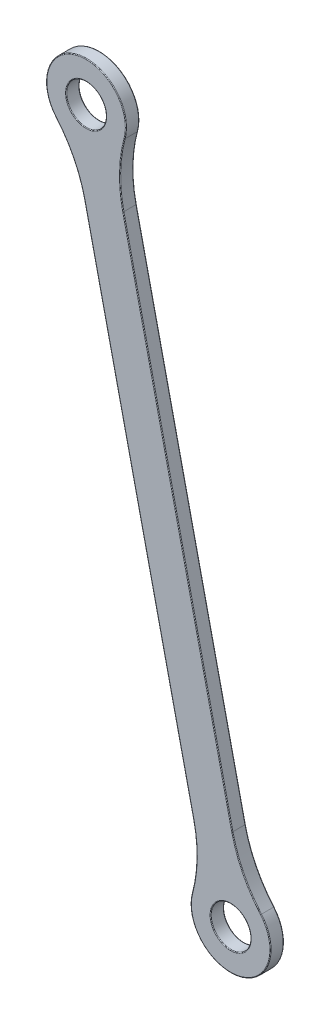
ISO-10303-21;
HEADER;
FILE_DESCRIPTION(('STEP AP214'),'2;1');
FILE_NAME('part.step','',(''),(''),'','','');
FILE_SCHEMA(('AUTOMOTIVE_DESIGN { 1 0 10303 214 1 1 1 1 }'));
ENDSEC;
DATA;
#1=APPLICATION_CONTEXT('core data for automotive mechanical design processes');
#2=APPLICATION_PROTOCOL_DEFINITION('international standard','automotive_design',2000,#1);
#3=PRODUCT_CONTEXT('',#1,'mechanical');
#4=PRODUCT('Part','Part','',(#3));
#5=PRODUCT_RELATED_PRODUCT_CATEGORY('part','',(#4));
#6=PRODUCT_DEFINITION_FORMATION('','',#4);
#7=PRODUCT_DEFINITION_CONTEXT('part definition',#1,'design');
#8=PRODUCT_DEFINITION('design','',#6,#7);
#9=PRODUCT_DEFINITION_SHAPE('','',#8);
#10=(LENGTH_UNIT() NAMED_UNIT(*) SI_UNIT(.MILLI.,.METRE.));
#11=(NAMED_UNIT(*) PLANE_ANGLE_UNIT() SI_UNIT($,.RADIAN.));
#12=(NAMED_UNIT(*) SI_UNIT($,.STERADIAN.) SOLID_ANGLE_UNIT());
#13=UNCERTAINTY_MEASURE_WITH_UNIT(LENGTH_MEASURE(1.E-05),#10,'distance_accuracy_value','');
#14=(GEOMETRIC_REPRESENTATION_CONTEXT(3) GLOBAL_UNCERTAINTY_ASSIGNED_CONTEXT((#13)) GLOBAL_UNIT_ASSIGNED_CONTEXT((#10,
#11,#12)) REPRESENTATION_CONTEXT('',''));
#15=CARTESIAN_POINT('',(0.,0.,0.));
#16=DIRECTION('',(0.,0.,1.));
#17=DIRECTION('',(1.,0.,0.));
#18=AXIS2_PLACEMENT_3D('',#15,#16,#17);
#19=CARTESIAN_POINT('',(14.5,81.5,-3.));
#20=DIRECTION('',(0.,0.,1.));
#21=DIRECTION('',(1.,0.,0.));
#22=AXIS2_PLACEMENT_3D('',#19,#20,#21);
#23=CYLINDRICAL_SURFACE('',#22,8.99999999999999);
#24=DIRECTION('',(0.,0.,1.));
#25=VECTOR('',#24,1.);
#26=CARTESIAN_POINT('',(21.3408329042481,87.3483335383813,-3.));
#27=LINE('',#26,#25);
#28=CARTESIAN_POINT('',(21.3408329042481,87.3483335383813,-2.85));
#29=VERTEX_POINT('',#28);
#30=CARTESIAN_POINT('',(21.3408329042481,87.3483335383813,-0.15));
#31=VERTEX_POINT('',#30);
#32=EDGE_CURVE('E301',#29,#31,#27,.T.);
#33=ORIENTED_EDGE('',*,*,#32,.T.);
#34=CARTESIAN_POINT('',(14.5,81.5,-0.15));
#35=DIRECTION('',(0.,0.,1.));
#36=DIRECTION('',(1.,0.,0.));
#37=AXIS2_PLACEMENT_3D('',#34,#35,#36);
#38=CIRCLE('',#37,8.99999999999999);
#39=CARTESIAN_POINT('',(5.8092709229788,83.8390656488902,-0.15));
#40=VERTEX_POINT('',#39);
#41=EDGE_CURVE('E223',#31,#40,#38,.F.);
#42=ORIENTED_EDGE('',*,*,#41,.T.);
#43=DIRECTION('',(0.,0.,1.));
#44=VECTOR('',#43,1.);
#45=CARTESIAN_POINT('',(5.8092709229788,83.8390656488902,-3.));
#46=LINE('',#45,#44);
#47=CARTESIAN_POINT('',(5.8092709229788,83.8390656488902,-2.85));
#48=VERTEX_POINT('',#47);
#49=EDGE_CURVE('E295',#40,#48,#46,.F.);
#50=ORIENTED_EDGE('',*,*,#49,.T.);
#51=CARTESIAN_POINT('',(14.5,81.5,-2.85));
#52=DIRECTION('',(0.,0.,1.));
#53=DIRECTION('',(1.,0.,0.));
#54=AXIS2_PLACEMENT_3D('',#51,#52,#53);
#55=CIRCLE('',#54,8.99999999999999);
#56=EDGE_CURVE('E221',#48,#29,#55,.T.);
#57=ORIENTED_EDGE('',*,*,#56,.T.);
#58=EDGE_LOOP('',(#33,#42,#50,#57));
#59=FACE_BOUND('',#58,.T.);
#60=ADVANCED_FACE('F35',(#59),#23,.T.);
#61=CARTESIAN_POINT('',(26.9264102543351,6.08386889861802,-3.));
#62=DIRECTION('',(0.975412105103872,0.220388804654032,0.));
#63=DIRECTION('',(-0.220388804654032,0.975412105103872,0.));
#64=AXIS2_PLACEMENT_3D('',#61,#62,#63);
#65=PLANE('',#64);
#66=DIRECTION('',(0.,0.,-1.));
#67=VECTOR('',#66,1.);
#68=CARTESIAN_POINT('',(6.10253715269095,98.2476152848119,0.));
#69=LINE('',#68,#67);
#70=CARTESIAN_POINT('',(6.10253715269095,98.2476152848119,-2.85));
#71=VERTEX_POINT('',#70);
#72=CARTESIAN_POINT('',(6.10253715269095,98.2476152848119,-0.15));
#73=VERTEX_POINT('',#72);
#74=EDGE_CURVE('E297',#71,#73,#69,.F.);
#75=ORIENTED_EDGE('',*,*,#74,.T.);
#76=DIRECTION('',(-0.220388804654032,0.975412105103872,0.));
#77=VECTOR('',#76,1.);
#78=CARTESIAN_POINT('',(-18.4987891874225,207.129877028675,-0.15));
#79=LINE('',#78,#77);
#80=CARTESIAN_POINT('',(-18.4987891874225,207.129877028675,-0.15));
#81=VERTEX_POINT('',#80);
#82=EDGE_CURVE('E198',#73,#81,#79,.T.);
#83=ORIENTED_EDGE('',*,*,#82,.T.);
#84=DIRECTION('',(0.,0.,1.));
#85=VECTOR('',#84,1.);
#86=CARTESIAN_POINT('',(-18.4987891874225,207.129877028675,-3.));
#87=LINE('',#86,#85);
#88=CARTESIAN_POINT('',(-18.4987891874225,207.129877028675,-2.85));
#89=VERTEX_POINT('',#88);
#90=EDGE_CURVE('E336',#81,#89,#87,.F.);
#91=ORIENTED_EDGE('',*,*,#90,.T.);
#92=DIRECTION('',(-0.220388804654032,0.975412105103872,0.));
#93=VECTOR('',#92,1.);
#94=CARTESIAN_POINT('',(26.9264102543351,6.08386889861802,-2.85));
#95=LINE('',#94,#93);
#96=EDGE_CURVE('E196',#89,#71,#95,.F.);
#97=ORIENTED_EDGE('',*,*,#96,.T.);
#98=EDGE_LOOP('',(#75,#83,#91,#97));
#99=FACE_BOUND('',#98,.T.);
#100=ADVANCED_FACE('F335',(#99),#65,.F.);
#101=CARTESIAN_POINT('',(-18.1175430887967,225.860991555373,-3.));
#102=DIRECTION('',(0.,0.,1.));
#103=DIRECTION('',(1.,0.,0.));
#104=AXIS2_PLACEMENT_3D('',#101,#102,#103);
#105=CYLINDRICAL_SURFACE('',#104,9.00000000000001);
#106=DIRECTION('',(0.,0.,1.));
#107=VECTOR('',#106,1.);
#108=CARTESIAN_POINT('',(-24.9583759930449,220.012658016992,-3.));
#109=LINE('',#108,#107);
#110=CARTESIAN_POINT('',(-24.9583759930449,220.012658016992,-2.85));
#111=VERTEX_POINT('',#110);
#112=CARTESIAN_POINT('',(-24.9583759930449,220.012658016992,-0.15));
#113=VERTEX_POINT('',#112);
#114=EDGE_CURVE('E258',#111,#113,#109,.T.);
#115=ORIENTED_EDGE('',*,*,#114,.T.);
#116=CARTESIAN_POINT('',(-18.1175430887967,225.860991555373,-0.15));
#117=DIRECTION('',(0.,0.,1.));
#118=DIRECTION('',(1.,0.,0.));
#119=AXIS2_PLACEMENT_3D('',#116,#117,#118);
#120=CIRCLE('',#119,9.00000000000001);
#121=CARTESIAN_POINT('',(-9.4268140117755,223.521925906483,-0.15));
#122=VERTEX_POINT('',#121);
#123=EDGE_CURVE('E206',#113,#122,#120,.F.);
#124=ORIENTED_EDGE('',*,*,#123,.T.);
#125=DIRECTION('',(0.,0.,1.));
#126=VECTOR('',#125,1.);
#127=CARTESIAN_POINT('',(-9.4268140117755,223.521925906483,-3.));
#128=LINE('',#127,#126);
#129=CARTESIAN_POINT('',(-9.4268140117755,223.521925906483,-2.85));
#130=VERTEX_POINT('',#129);
#131=EDGE_CURVE('E305',#122,#130,#128,.F.);
#132=ORIENTED_EDGE('',*,*,#131,.T.);
#133=CARTESIAN_POINT('',(-18.1175430887967,225.860991555373,-2.85));
#134=DIRECTION('',(0.,0.,1.));
#135=DIRECTION('',(1.,0.,0.));
#136=AXIS2_PLACEMENT_3D('',#133,#134,#135);
#137=CIRCLE('',#136,9.00000000000001);
#138=EDGE_CURVE('E204',#130,#111,#137,.T.);
#139=ORIENTED_EDGE('',*,*,#138,.T.);
#140=EDGE_LOOP('',(#115,#124,#132,#139));
#141=FACE_BOUND('',#140,.T.);
#142=ADVANCED_FACE('F347',(#141),#105,.T.);
#143=CARTESIAN_POINT('',(-18.1175430887967,225.860991555373,-3.));
#144=DIRECTION('',(0.,0.,1.));
#145=DIRECTION('',(1.,0.,0.));
#146=AXIS2_PLACEMENT_3D('',#143,#144,#145);
#147=CYLINDRICAL_SURFACE('',#146,4.5);
#148=CARTESIAN_POINT('',(-18.1175430887967,225.860991555373,-0.15));
#149=DIRECTION('',(0.,0.,1.));
#150=DIRECTION('',(1.,0.,0.));
#151=AXIS2_PLACEMENT_3D('',#148,#149,#150);
#152=CIRCLE('',#151,4.5);
#153=CARTESIAN_POINT('',(-13.6175430887967,225.860991555373,-0.15));
#154=VERTEX_POINT('',#153);
#155=EDGE_CURVE('E190',#154,#154,#152,.T.);
#156=ORIENTED_EDGE('',*,*,#155,.T.);
#157=EDGE_LOOP('',(#156));
#158=FACE_BOUND('',#157,.T.);
#159=CARTESIAN_POINT('',(-18.1175430887967,225.860991555373,-2.85));
#160=DIRECTION('',(0.,0.,1.));
#161=DIRECTION('',(1.,0.,0.));
#162=AXIS2_PLACEMENT_3D('',#159,#160,#161);
#163=CIRCLE('',#162,4.5);
#164=CARTESIAN_POINT('',(-13.6175430887967,225.860991555373,-2.85));
#165=VERTEX_POINT('',#164);
#166=EDGE_CURVE('E187',#165,#165,#163,.F.);
#167=ORIENTED_EDGE('',*,*,#166,.T.);
#168=EDGE_LOOP('',(#167));
#169=FACE_BOUND('',#168,.T.);
#170=ADVANCED_FACE('F623',(#158,#169),#147,.F.);
#171=CARTESIAN_POINT('',(35.70511920027,8.06736814050431,-3.));
#172=DIRECTION('',(0.975412105103872,0.220388804654032,0.));
#173=DIRECTION('',(-0.220388804654032,0.975412105103872,0.));
#174=AXIS2_PLACEMENT_3D('',#171,#172,#173);
#175=PLANE('',#174);
#176=DIRECTION('',(0.,0.,-1.));
#177=VECTOR('',#176,1.);
#178=CARTESIAN_POINT('',(-9.72008024148765,209.113376270561,0.));
#179=LINE('',#178,#177);
#180=CARTESIAN_POINT('',(-9.72008024148765,209.113376270561,-2.85));
#181=VERTEX_POINT('',#180);
#182=CARTESIAN_POINT('',(-9.72008024148765,209.113376270561,-0.15));
#183=VERTEX_POINT('',#182);
#184=EDGE_CURVE('E338',#181,#183,#179,.F.);
#185=ORIENTED_EDGE('',*,*,#184,.T.);
#186=DIRECTION('',(-0.220388804654032,0.975412105103872,0.));
#187=VECTOR('',#186,1.);
#188=CARTESIAN_POINT('',(35.70511920027,8.06736814050431,-0.15));
#189=LINE('',#188,#187);
#190=CARTESIAN_POINT('',(14.8812460986258,100.231114526698,-0.15));
#191=VERTEX_POINT('',#190);
#192=EDGE_CURVE('E215',#183,#191,#189,.F.);
#193=ORIENTED_EDGE('',*,*,#192,.T.);
#194=DIRECTION('',(0.,0.,1.));
#195=VECTOR('',#194,1.);
#196=CARTESIAN_POINT('',(14.8812460986258,100.231114526698,-3.));
#197=LINE('',#196,#195);
#198=CARTESIAN_POINT('',(14.8812460986258,100.231114526698,-2.85));
#199=VERTEX_POINT('',#198);
#200=EDGE_CURVE('E303',#191,#199,#197,.F.);
#201=ORIENTED_EDGE('',*,*,#200,.T.);
#202=DIRECTION('',(-0.220388804654032,0.975412105103872,0.));
#203=VECTOR('',#202,1.);
#204=CARTESIAN_POINT('',(-9.72008024148767,209.113376270561,-2.85));
#205=LINE('',#204,#203);
#206=EDGE_CURVE('E213',#199,#181,#205,.T.);
#207=ORIENTED_EDGE('',*,*,#206,.T.);
#208=EDGE_LOOP('',(#185,#193,#201,#207));
#209=FACE_BOUND('',#208,.T.);
#210=ADVANCED_FACE('F383',(#209),#175,.T.);
#211=CARTESIAN_POINT('',(14.5,81.5,-3.));
#212=DIRECTION('',(0.,0.,1.));
#213=DIRECTION('',(1.,0.,0.));
#214=AXIS2_PLACEMENT_3D('',#211,#212,#213);
#215=CYLINDRICAL_SURFACE('',#214,4.5);
#216=CARTESIAN_POINT('',(14.5,81.5,-0.15));
#217=DIRECTION('',(0.,0.,1.));
#218=DIRECTION('',(1.,0.,0.));
#219=AXIS2_PLACEMENT_3D('',#216,#217,#218);
#220=CIRCLE('',#219,4.5);
#221=CARTESIAN_POINT('',(19.,81.5,-0.15));
#222=VERTEX_POINT('',#221);
#223=EDGE_CURVE('E170',#222,#222,#220,.T.);
#224=ORIENTED_EDGE('',*,*,#223,.T.);
#225=EDGE_LOOP('',(#224));
#226=FACE_BOUND('',#225,.T.);
#227=CARTESIAN_POINT('',(14.5,81.5,-2.85));
#228=DIRECTION('',(0.,0.,1.));
#229=DIRECTION('',(1.,0.,0.));
#230=AXIS2_PLACEMENT_3D('',#227,#228,#229);
#231=CIRCLE('',#230,4.5);
#232=CARTESIAN_POINT('',(19.,81.5,-2.85));
#233=VERTEX_POINT('',#232);
#234=EDGE_CURVE('E311',#233,#233,#231,.F.);
#235=ORIENTED_EDGE('',*,*,#234,.T.);
#236=EDGE_LOOP('',(#235));
#237=FACE_BOUND('',#236,.T.);
#238=ADVANCED_FACE('F601',(#226,#237),#215,.F.);
#239=CARTESIAN_POINT('',(0.,0.,-3.));
#240=DIRECTION('',(0.,0.,1.));
#241=DIRECTION('',(1.,0.,0.));
#242=AXIS2_PLACEMENT_3D('',#239,#240,#241);
#243=PLANE('',#242);
#244=CARTESIAN_POINT('',(14.5,81.5,-3.));
#245=DIRECTION('',(0.,0.,1.));
#246=DIRECTION('',(1.,0.,0.));
#247=AXIS2_PLACEMENT_3D('',#244,#245,#246);
#248=CIRCLE('',#247,4.65);
#249=CARTESIAN_POINT('',(19.15,81.5,-3.));
#250=VERTEX_POINT('',#249);
#251=EDGE_CURVE('E11',#250,#250,#248,.T.);
#252=ORIENTED_EDGE('',*,*,#251,.T.);
#253=EDGE_LOOP('',(#252));
#254=FACE_BOUND('',#253,.T.);
#255=CARTESIAN_POINT('',(-18.1175430887967,225.860991555373,-3.));
#256=DIRECTION('',(0.,0.,1.));
#257=DIRECTION('',(1.,0.,0.));
#258=AXIS2_PLACEMENT_3D('',#255,#256,#257);
#259=CIRCLE('',#258,4.65);
#260=CARTESIAN_POINT('',(-13.4675430887967,225.860991555373,-3.));
#261=VERTEX_POINT('',#260);
#262=EDGE_CURVE('E44',#261,#261,#259,.T.);
#263=ORIENTED_EDGE('',*,*,#262,.T.);
#264=EDGE_LOOP('',(#263));
#265=FACE_BOUND('',#264,.T.);
#266=CARTESIAN_POINT('',(-18.1175430887967,225.860991555373,-3.));
#267=DIRECTION('',(0.,0.,1.));
#268=DIRECTION('',(1.,0.,0.));
#269=AXIS2_PLACEMENT_3D('',#266,#267,#268);
#270=CIRCLE('',#269,8.85);
#271=CARTESIAN_POINT('',(-24.8443621113074,220.110130242631,-3.));
#272=VERTEX_POINT('',#271);
#273=CARTESIAN_POINT('',(-9.57165949639252,223.560910333964,-3.));
#274=VERTEX_POINT('',#273);
#275=EDGE_CURVE('E52',#272,#274,#270,.F.);
#276=ORIENTED_EDGE('',*,*,#275,.T.);
#277=CARTESIAN_POINT('',(19.5422829116285,215.725040410182,-3.));
#278=DIRECTION('',(0.,0.,1.));
#279=DIRECTION('',(1.,0.,0.));
#280=AXIS2_PLACEMENT_3D('',#277,#278,#279);
#281=CIRCLE('',#280,30.15);
#282=CARTESIAN_POINT('',(-9.86639205725324,209.080317949863,-3.));
#283=VERTEX_POINT('',#282);
#284=EDGE_CURVE('E237',#274,#283,#281,.T.);
#285=ORIENTED_EDGE('',*,*,#284,.T.);
#286=DIRECTION('',(-0.220388804654032,0.975412105103872,0.));
#287=VECTOR('',#286,1.);
#288=CARTESIAN_POINT('',(14.7349342828602,100.198056206,-3.));
#289=LINE('',#288,#287);
#290=CARTESIAN_POINT('',(14.7349342828602,100.198056206,-3.));
#291=VERTEX_POINT('',#290);
#292=EDGE_CURVE('E225',#283,#291,#289,.F.);
#293=ORIENTED_EDGE('',*,*,#292,.T.);
#294=CARTESIAN_POINT('',(44.143609251742,106.842778666319,-3.));
#295=DIRECTION('',(0.,0.,1.));
#296=DIRECTION('',(1.,0.,0.));
#297=AXIS2_PLACEMENT_3D('',#294,#295,#296);
#298=CIRCLE('',#297,30.15);
#299=CARTESIAN_POINT('',(21.2268190225107,87.2508613127416,-3.));
#300=VERTEX_POINT('',#299);
#301=EDGE_CURVE('E227',#291,#300,#298,.T.);
#302=ORIENTED_EDGE('',*,*,#301,.T.);
#303=CARTESIAN_POINT('',(14.5,81.5,-3.));
#304=DIRECTION('',(0.,0.,1.));
#305=DIRECTION('',(1.,0.,0.));
#306=AXIS2_PLACEMENT_3D('',#303,#304,#305);
#307=CIRCLE('',#306,8.84999999999999);
#308=CARTESIAN_POINT('',(5.95411640759583,83.8000812214087,-3.));
#309=VERTEX_POINT('',#308);
#310=EDGE_CURVE('E229',#300,#309,#307,.F.);
#311=ORIENTED_EDGE('',*,*,#310,.T.);
#312=CARTESIAN_POINT('',(-23.1598260004252,91.6359511451909,-3.));
#313=DIRECTION('',(0.,0.,1.));
#314=DIRECTION('',(1.,0.,0.));
#315=AXIS2_PLACEMENT_3D('',#312,#313,#314);
#316=CIRCLE('',#315,30.15);
#317=CARTESIAN_POINT('',(6.24884896845654,98.28067360551,-3.));
#318=VERTEX_POINT('',#317);
#319=EDGE_CURVE('E231',#309,#318,#316,.T.);
#320=ORIENTED_EDGE('',*,*,#319,.T.);
#321=DIRECTION('',(-0.220388804654032,0.975412105103872,0.));
#322=VECTOR('',#321,1.);
#323=CARTESIAN_POINT('',(27.0727220701007,6.11692721931613,-3.));
#324=LINE('',#323,#322);
#325=CARTESIAN_POINT('',(-18.3524773716569,207.162935349373,-3.));
#326=VERTEX_POINT('',#325);
#327=EDGE_CURVE('E233',#318,#326,#324,.T.);
#328=ORIENTED_EDGE('',*,*,#327,.T.);
#329=CARTESIAN_POINT('',(-47.7611523405386,200.518212889054,-3.));
#330=DIRECTION('',(0.,0.,1.));
#331=DIRECTION('',(1.,0.,0.));
#332=AXIS2_PLACEMENT_3D('',#329,#330,#331);
#333=CIRCLE('',#332,30.15);
#334=EDGE_CURVE('E57',#326,#272,#333,.T.);
#335=ORIENTED_EDGE('',*,*,#334,.T.);
#336=EDGE_LOOP('',(#276,#285,#293,#302,#311,#320,#328,#335));
#337=FACE_BOUND('',#336,.T.);
#338=ADVANCED_FACE('F588',(#254,#265,#337),#243,.F.);
#339=CARTESIAN_POINT('',(0.,0.,0.));
#340=DIRECTION('',(0.,0.,1.));
#341=DIRECTION('',(1.,0.,0.));
#342=AXIS2_PLACEMENT_3D('',#339,#340,#341);
#343=PLANE('',#342);
#344=CARTESIAN_POINT('',(14.5,81.5,0.));
#345=DIRECTION('',(0.,0.,1.));
#346=DIRECTION('',(1.,0.,0.));
#347=AXIS2_PLACEMENT_3D('',#344,#345,#346);
#348=CIRCLE('',#347,4.65);
#349=CARTESIAN_POINT('',(19.15,81.5,0.));
#350=VERTEX_POINT('',#349);
#351=EDGE_CURVE('E179',#350,#350,#348,.F.);
#352=ORIENTED_EDGE('',*,*,#351,.T.);
#353=EDGE_LOOP('',(#352));
#354=FACE_BOUND('',#353,.T.);
#355=CARTESIAN_POINT('',(-18.1175430887967,225.860991555373,0.));
#356=DIRECTION('',(0.,0.,1.));
#357=DIRECTION('',(1.,0.,0.));
#358=AXIS2_PLACEMENT_3D('',#355,#356,#357);
#359=CIRCLE('',#358,4.65);
#360=CARTESIAN_POINT('',(-13.4675430887967,225.860991555373,0.));
#361=VERTEX_POINT('',#360);
#362=EDGE_CURVE('E176',#361,#361,#359,.F.);
#363=ORIENTED_EDGE('',*,*,#362,.T.);
#364=EDGE_LOOP('',(#363));
#365=FACE_BOUND('',#364,.T.);
#366=DIRECTION('',(-0.220388804654032,0.975412105103872,0.));
#367=VECTOR('',#366,1.);
#368=CARTESIAN_POINT('',(6.24884896845653,98.28067360551,0.));
#369=LINE('',#368,#367);
#370=CARTESIAN_POINT('',(-18.3524773716569,207.162935349373,0.));
#371=VERTEX_POINT('',#370);
#372=CARTESIAN_POINT('',(6.24884896845654,98.28067360551,0.));
#373=VERTEX_POINT('',#372);
#374=EDGE_CURVE('E174',#371,#373,#369,.F.);
#375=ORIENTED_EDGE('',*,*,#374,.T.);
#376=CARTESIAN_POINT('',(-23.1598260004252,91.6359511451909,0.));
#377=DIRECTION('',(0.,0.,1.));
#378=DIRECTION('',(1.,0.,0.));
#379=AXIS2_PLACEMENT_3D('',#376,#377,#378);
#380=CIRCLE('',#379,30.15);
#381=CARTESIAN_POINT('',(5.95411640759583,83.8000812214087,0.));
#382=VERTEX_POINT('',#381);
#383=EDGE_CURVE('E155',#373,#382,#380,.F.);
#384=ORIENTED_EDGE('',*,*,#383,.T.);
#385=CARTESIAN_POINT('',(14.5,81.5,0.));
#386=DIRECTION('',(0.,0.,1.));
#387=DIRECTION('',(1.,0.,0.));
#388=AXIS2_PLACEMENT_3D('',#385,#386,#387);
#389=CIRCLE('',#388,8.84999999999999);
#390=CARTESIAN_POINT('',(21.2268190225107,87.2508613127416,0.));
#391=VERTEX_POINT('',#390);
#392=EDGE_CURVE('E163',#382,#391,#389,.T.);
#393=ORIENTED_EDGE('',*,*,#392,.T.);
#394=CARTESIAN_POINT('',(44.143609251742,106.842778666319,0.));
#395=DIRECTION('',(0.,0.,1.));
#396=DIRECTION('',(1.,0.,0.));
#397=AXIS2_PLACEMENT_3D('',#394,#395,#396);
#398=CIRCLE('',#397,30.15);
#399=CARTESIAN_POINT('',(14.7349342828602,100.198056206,0.));
#400=VERTEX_POINT('',#399);
#401=EDGE_CURVE('E169',#391,#400,#398,.F.);
#402=ORIENTED_EDGE('',*,*,#401,.T.);
#403=DIRECTION('',(-0.220388804654032,0.975412105103872,0.));
#404=VECTOR('',#403,1.);
#405=CARTESIAN_POINT('',(35.5588073845044,8.03430981980621,0.));
#406=LINE('',#405,#404);
#407=CARTESIAN_POINT('',(-9.86639205725323,209.080317949863,0.));
#408=VERTEX_POINT('',#407);
#409=EDGE_CURVE('E317',#400,#408,#406,.T.);
#410=ORIENTED_EDGE('',*,*,#409,.T.);
#411=CARTESIAN_POINT('',(19.5422829116285,215.725040410182,0.));
#412=DIRECTION('',(0.,0.,1.));
#413=DIRECTION('',(1.,0.,0.));
#414=AXIS2_PLACEMENT_3D('',#411,#412,#413);
#415=CIRCLE('',#414,30.15);
#416=CARTESIAN_POINT('',(-9.57165949639252,223.560910333964,0.));
#417=VERTEX_POINT('',#416);
#418=EDGE_CURVE('E319',#408,#417,#415,.F.);
#419=ORIENTED_EDGE('',*,*,#418,.T.);
#420=CARTESIAN_POINT('',(-18.1175430887967,225.860991555373,0.));
#421=DIRECTION('',(0.,0.,1.));
#422=DIRECTION('',(1.,0.,0.));
#423=AXIS2_PLACEMENT_3D('',#420,#421,#422);
#424=CIRCLE('',#423,8.85);
#425=CARTESIAN_POINT('',(-24.8443621113074,220.110130242631,0.));
#426=VERTEX_POINT('',#425);
#427=EDGE_CURVE('E321',#417,#426,#424,.T.);
#428=ORIENTED_EDGE('',*,*,#427,.T.);
#429=CARTESIAN_POINT('',(-47.7611523405386,200.518212889054,0.));
#430=DIRECTION('',(0.,0.,1.));
#431=DIRECTION('',(1.,0.,0.));
#432=AXIS2_PLACEMENT_3D('',#429,#430,#431);
#433=CIRCLE('',#432,30.15);
#434=EDGE_CURVE('E181',#426,#371,#433,.F.);
#435=ORIENTED_EDGE('',*,*,#434,.T.);
#436=EDGE_LOOP('',(#375,#384,#393,#402,#410,#419,#428,#435));
#437=FACE_BOUND('',#436,.T.);
#438=ADVANCED_FACE('F172',(#354,#365,#437),#343,.T.);
#439=CARTESIAN_POINT('',(-47.7611523405386,200.518212889054,-3.));
#440=DIRECTION('',(0.,0.,1.));
#441=DIRECTION('',(1.,0.,0.));
#442=AXIS2_PLACEMENT_3D('',#439,#440,#441);
#443=CYLINDRICAL_SURFACE('',#442,30.);
#444=ORIENTED_EDGE('',*,*,#90,.F.);
#445=CARTESIAN_POINT('',(-47.7611523405386,200.518212889054,-0.15));
#446=DIRECTION('',(0.,0.,1.));
#447=DIRECTION('',(1.,0.,0.));
#448=AXIS2_PLACEMENT_3D('',#445,#446,#447);
#449=CIRCLE('',#448,30.);
#450=EDGE_CURVE('E202',#81,#113,#449,.T.);
#451=ORIENTED_EDGE('',*,*,#450,.T.);
#452=ORIENTED_EDGE('',*,*,#114,.F.);
#453=CARTESIAN_POINT('',(-47.7611523405386,200.518212889054,-2.85));
#454=DIRECTION('',(0.,0.,1.));
#455=DIRECTION('',(1.,0.,0.));
#456=AXIS2_PLACEMENT_3D('',#453,#454,#455);
#457=CIRCLE('',#456,30.);
#458=EDGE_CURVE('E200',#111,#89,#457,.F.);
#459=ORIENTED_EDGE('',*,*,#458,.T.);
#460=EDGE_LOOP('',(#444,#451,#452,#459));
#461=FACE_BOUND('',#460,.T.);
#462=ADVANCED_FACE('F385',(#461),#443,.F.);
#463=CARTESIAN_POINT('',(19.5422829116285,215.725040410182,-3.));
#464=DIRECTION('',(0.,0.,1.));
#465=DIRECTION('',(1.,0.,0.));
#466=AXIS2_PLACEMENT_3D('',#463,#464,#465);
#467=CYLINDRICAL_SURFACE('',#466,30.);
#468=ORIENTED_EDGE('',*,*,#131,.F.);
#469=CARTESIAN_POINT('',(19.5422829116285,215.725040410182,-0.15));
#470=DIRECTION('',(0.,0.,1.));
#471=DIRECTION('',(1.,0.,0.));
#472=AXIS2_PLACEMENT_3D('',#469,#470,#471);
#473=CIRCLE('',#472,30.);
#474=EDGE_CURVE('E211',#122,#183,#473,.T.);
#475=ORIENTED_EDGE('',*,*,#474,.T.);
#476=ORIENTED_EDGE('',*,*,#184,.F.);
#477=CARTESIAN_POINT('',(19.5422829116285,215.725040410182,-2.85));
#478=DIRECTION('',(0.,0.,1.));
#479=DIRECTION('',(1.,0.,0.));
#480=AXIS2_PLACEMENT_3D('',#477,#478,#479);
#481=CIRCLE('',#480,30.);
#482=EDGE_CURVE('E208',#181,#130,#481,.F.);
#483=ORIENTED_EDGE('',*,*,#482,.T.);
#484=EDGE_LOOP('',(#468,#475,#476,#483));
#485=FACE_BOUND('',#484,.T.);
#486=ADVANCED_FACE('F353',(#485),#467,.F.);
#487=CARTESIAN_POINT('',(-23.1598260004252,91.6359511451909,-3.));
#488=DIRECTION('',(0.,0.,1.));
#489=DIRECTION('',(1.,0.,0.));
#490=AXIS2_PLACEMENT_3D('',#487,#488,#489);
#491=CYLINDRICAL_SURFACE('',#490,30.);
#492=ORIENTED_EDGE('',*,*,#49,.F.);
#493=CARTESIAN_POINT('',(-23.1598260004252,91.6359511451909,-0.15));
#494=DIRECTION('',(0.,0.,1.));
#495=DIRECTION('',(1.,0.,0.));
#496=AXIS2_PLACEMENT_3D('',#493,#494,#495);
#497=CIRCLE('',#496,30.);
#498=EDGE_CURVE('E157',#40,#73,#497,.T.);
#499=ORIENTED_EDGE('',*,*,#498,.T.);
#500=ORIENTED_EDGE('',*,*,#74,.F.);
#501=CARTESIAN_POINT('',(-23.1598260004252,91.6359511451909,-2.85));
#502=DIRECTION('',(0.,0.,1.));
#503=DIRECTION('',(1.,0.,0.));
#504=AXIS2_PLACEMENT_3D('',#501,#502,#503);
#505=CIRCLE('',#504,30.);
#506=EDGE_CURVE('E193',#71,#48,#505,.F.);
#507=ORIENTED_EDGE('',*,*,#506,.T.);
#508=EDGE_LOOP('',(#492,#499,#500,#507));
#509=FACE_BOUND('',#508,.T.);
#510=ADVANCED_FACE('F294',(#509),#491,.F.);
#511=CARTESIAN_POINT('',(44.143609251742,106.842778666319,-3.));
#512=DIRECTION('',(0.,0.,1.));
#513=DIRECTION('',(1.,0.,0.));
#514=AXIS2_PLACEMENT_3D('',#511,#512,#513);
#515=CYLINDRICAL_SURFACE('',#514,30.);
#516=ORIENTED_EDGE('',*,*,#200,.F.);
#517=CARTESIAN_POINT('',(44.143609251742,106.842778666319,-0.15));
#518=DIRECTION('',(0.,0.,1.));
#519=DIRECTION('',(1.,0.,0.));
#520=AXIS2_PLACEMENT_3D('',#517,#518,#519);
#521=CIRCLE('',#520,30.);
#522=EDGE_CURVE('E219',#191,#31,#521,.T.);
#523=ORIENTED_EDGE('',*,*,#522,.T.);
#524=ORIENTED_EDGE('',*,*,#32,.F.);
#525=CARTESIAN_POINT('',(44.143609251742,106.842778666319,-2.85));
#526=DIRECTION('',(0.,0.,1.));
#527=DIRECTION('',(1.,0.,0.));
#528=AXIS2_PLACEMENT_3D('',#525,#526,#527);
#529=CIRCLE('',#528,30.);
#530=EDGE_CURVE('E217',#29,#199,#529,.F.);
#531=ORIENTED_EDGE('',*,*,#530,.T.);
#532=EDGE_LOOP('',(#516,#523,#524,#531));
#533=FACE_BOUND('',#532,.T.);
#534=ADVANCED_FACE('F392',(#533),#515,.F.);
#535=CARTESIAN_POINT('',(14.5,81.5,-0.15));
#536=DIRECTION('',(0.,0.,1.));
#537=DIRECTION('',(1.,0.,0.));
#538=AXIS2_PLACEMENT_3D('',#535,#536,#537);
#539=TOROIDAL_SURFACE('',#538,4.65,0.15);
#540=ORIENTED_EDGE('',*,*,#351,.F.);
#541=EDGE_LOOP('',(#540));
#542=FACE_BOUND('',#541,.T.);
#543=ORIENTED_EDGE('',*,*,#223,.F.);
#544=EDGE_LOOP('',(#543));
#545=FACE_BOUND('',#544,.T.);
#546=ADVANCED_FACE('F395',(#542,#545),#539,.T.);
#547=CARTESIAN_POINT('',(-18.1175430887967,225.860991555373,-0.15));
#548=DIRECTION('',(0.,0.,1.));
#549=DIRECTION('',(1.,0.,0.));
#550=AXIS2_PLACEMENT_3D('',#547,#548,#549);
#551=TOROIDAL_SURFACE('',#550,4.65,0.15);
#552=ORIENTED_EDGE('',*,*,#155,.F.);
#553=EDGE_LOOP('',(#552));
#554=FACE_BOUND('',#553,.T.);
#555=ORIENTED_EDGE('',*,*,#362,.F.);
#556=EDGE_LOOP('',(#555));
#557=FACE_BOUND('',#556,.T.);
#558=ADVANCED_FACE('F373',(#554,#557),#551,.T.);
#559=CARTESIAN_POINT('',(19.5422829116285,215.725040410182,-0.15));
#560=DIRECTION('',(0.,0.,1.));
#561=DIRECTION('',(1.,0.,0.));
#562=AXIS2_PLACEMENT_3D('',#559,#560,#561);
#563=TOROIDAL_SURFACE('',#562,30.15,0.15);
#564=CARTESIAN_POINT('',(-9.86639205725323,209.080317949863,-0.15));
#565=DIRECTION('',(0.22038880465406,-0.975412105103866,0.));
#566=DIRECTION('',(0.975412105103866,0.22038880465406,0.));
#567=AXIS2_PLACEMENT_3D('',#564,#565,#566);
#568=CIRCLE('',#567,0.15);
#569=EDGE_CURVE('E252',#183,#408,#568,.T.);
#570=ORIENTED_EDGE('',*,*,#569,.F.);
#571=ORIENTED_EDGE('',*,*,#474,.F.);
#572=CARTESIAN_POINT('',(-9.57165949639252,223.560910333964,-0.15));
#573=DIRECTION('',(0.259896183210092,0.965636564113449,0.));
#574=DIRECTION('',(-0.965636564113449,0.259896183210092,0.));
#575=AXIS2_PLACEMENT_3D('',#572,#573,#574);
#576=CIRCLE('',#575,0.15);
#577=EDGE_CURVE('E255',#417,#122,#576,.T.);
#578=ORIENTED_EDGE('',*,*,#577,.F.);
#579=ORIENTED_EDGE('',*,*,#418,.F.);
#580=EDGE_LOOP('',(#570,#571,#578,#579));
#581=FACE_BOUND('',#580,.T.);
#582=ADVANCED_FACE('F359',(#581),#563,.T.);
#583=CARTESIAN_POINT('',(-18.1175430887967,225.860991555373,-0.15));
#584=DIRECTION('',(0.,0.,1.));
#585=DIRECTION('',(1.,0.,0.));
#586=AXIS2_PLACEMENT_3D('',#583,#584,#585);
#587=TOROIDAL_SURFACE('',#586,8.85,0.15);
#588=ORIENTED_EDGE('',*,*,#577,.T.);
#589=ORIENTED_EDGE('',*,*,#123,.F.);
#590=CARTESIAN_POINT('',(-24.8443621113074,220.110130242631,-0.15));
#591=DIRECTION('',(0.649814837597919,-0.760092544916466,0.));
#592=DIRECTION('',(0.760092544916466,0.649814837597919,0.));
#593=AXIS2_PLACEMENT_3D('',#590,#591,#592);
#594=CIRCLE('',#593,0.15);
#595=EDGE_CURVE('E249',#426,#113,#594,.T.);
#596=ORIENTED_EDGE('',*,*,#595,.F.);
#597=ORIENTED_EDGE('',*,*,#427,.F.);
#598=EDGE_LOOP('',(#588,#589,#596,#597));
#599=FACE_BOUND('',#598,.T.);
#600=ADVANCED_FACE('F363',(#599),#587,.T.);
#601=CARTESIAN_POINT('',(35.5588073845044,8.03430981980621,-0.15));
#602=DIRECTION('',(-0.220388804654032,0.975412105103872,0.));
#603=DIRECTION('',(-0.975412105103872,-0.220388804654032,0.));
#604=AXIS2_PLACEMENT_3D('',#601,#602,#603);
#605=CYLINDRICAL_SURFACE('',#604,0.15);
#606=ORIENTED_EDGE('',*,*,#569,.T.);
#607=ORIENTED_EDGE('',*,*,#409,.F.);
#608=CARTESIAN_POINT('',(14.7349342828602,100.198056206,-0.15));
#609=DIRECTION('',(0.22038880465406,-0.975412105103865,0.));
#610=DIRECTION('',(0.975412105103866,0.22038880465406,0.));
#611=AXIS2_PLACEMENT_3D('',#608,#609,#610);
#612=CIRCLE('',#611,0.15);
#613=EDGE_CURVE('E246',#191,#400,#612,.T.);
#614=ORIENTED_EDGE('',*,*,#613,.F.);
#615=ORIENTED_EDGE('',*,*,#192,.F.);
#616=EDGE_LOOP('',(#606,#607,#614,#615));
#617=FACE_BOUND('',#616,.T.);
#618=ADVANCED_FACE('F365',(#617),#605,.T.);
#619=CARTESIAN_POINT('',(-47.7611523405386,200.518212889054,-0.15));
#620=DIRECTION('',(0.,0.,1.));
#621=DIRECTION('',(1.,0.,0.));
#622=AXIS2_PLACEMENT_3D('',#619,#620,#621);
#623=TOROIDAL_SURFACE('',#622,30.15,0.15);
#624=ORIENTED_EDGE('',*,*,#595,.T.);
#625=ORIENTED_EDGE('',*,*,#450,.F.);
#626=CARTESIAN_POINT('',(-18.3524773716569,207.162935349373,-0.15));
#627=DIRECTION('',(0.220388804654063,-0.975412105103865,0.));
#628=DIRECTION('',(0.975412105103865,0.220388804654063,0.));
#629=AXIS2_PLACEMENT_3D('',#626,#627,#628);
#630=CIRCLE('',#629,0.15);
#631=EDGE_CURVE('E243',#371,#81,#630,.T.);
#632=ORIENTED_EDGE('',*,*,#631,.F.);
#633=ORIENTED_EDGE('',*,*,#434,.F.);
#634=EDGE_LOOP('',(#624,#625,#632,#633));
#635=FACE_BOUND('',#634,.T.);
#636=ADVANCED_FACE('F328',(#635),#623,.T.);
#637=CARTESIAN_POINT('',(44.143609251742,106.842778666319,-0.15));
#638=DIRECTION('',(0.,0.,1.));
#639=DIRECTION('',(1.,0.,0.));
#640=AXIS2_PLACEMENT_3D('',#637,#638,#639);
#641=TOROIDAL_SURFACE('',#640,30.15,0.15);
#642=ORIENTED_EDGE('',*,*,#613,.T.);
#643=ORIENTED_EDGE('',*,*,#401,.F.);
#644=CARTESIAN_POINT('',(21.2268190225107,87.2508613127416,-0.15));
#645=DIRECTION('',(0.649814837597931,-0.760092544916456,0.));
#646=DIRECTION('',(0.760092544916456,0.649814837597931,0.));
#647=AXIS2_PLACEMENT_3D('',#644,#645,#646);
#648=CIRCLE('',#647,0.15);
#649=EDGE_CURVE('E166',#31,#391,#648,.T.);
#650=ORIENTED_EDGE('',*,*,#649,.F.);
#651=ORIENTED_EDGE('',*,*,#522,.F.);
#652=EDGE_LOOP('',(#642,#643,#650,#651));
#653=FACE_BOUND('',#652,.T.);
#654=ADVANCED_FACE('F410',(#653),#641,.T.);
#655=CARTESIAN_POINT('',(27.0727220701007,6.11692721931613,-0.15));
#656=DIRECTION('',(0.220388804654032,-0.975412105103872,0.));
#657=DIRECTION('',(0.975412105103872,0.220388804654032,0.));
#658=AXIS2_PLACEMENT_3D('',#655,#656,#657);
#659=CYLINDRICAL_SURFACE('',#658,0.15);
#660=ORIENTED_EDGE('',*,*,#631,.T.);
#661=ORIENTED_EDGE('',*,*,#82,.F.);
#662=CARTESIAN_POINT('',(6.24884896845654,98.28067360551,-0.15));
#663=DIRECTION('',(0.220388804654063,-0.975412105103865,0.));
#664=DIRECTION('',(0.975412105103865,0.220388804654063,0.));
#665=AXIS2_PLACEMENT_3D('',#662,#663,#664);
#666=CIRCLE('',#665,0.15);
#667=EDGE_CURVE('E160',#373,#73,#666,.T.);
#668=ORIENTED_EDGE('',*,*,#667,.F.);
#669=ORIENTED_EDGE('',*,*,#374,.F.);
#670=EDGE_LOOP('',(#660,#661,#668,#669));
#671=FACE_BOUND('',#670,.T.);
#672=ADVANCED_FACE('F331',(#671),#659,.T.);
#673=CARTESIAN_POINT('',(14.5,81.5,-0.15));
#674=DIRECTION('',(0.,0.,1.));
#675=DIRECTION('',(1.,0.,0.));
#676=AXIS2_PLACEMENT_3D('',#673,#674,#675);
#677=TOROIDAL_SURFACE('',#676,8.84999999999999,0.15);
#678=ORIENTED_EDGE('',*,*,#649,.T.);
#679=ORIENTED_EDGE('',*,*,#392,.F.);
#680=CARTESIAN_POINT('',(5.95411640759583,83.8000812214087,-0.15));
#681=DIRECTION('',(0.259896183210004,0.965636564113472,0.));
#682=DIRECTION('',(-0.965636564113472,0.259896183210004,0.));
#683=AXIS2_PLACEMENT_3D('',#680,#681,#682);
#684=CIRCLE('',#683,0.15);
#685=EDGE_CURVE('E151',#40,#382,#684,.T.);
#686=ORIENTED_EDGE('',*,*,#685,.F.);
#687=ORIENTED_EDGE('',*,*,#41,.F.);
#688=EDGE_LOOP('',(#678,#679,#686,#687));
#689=FACE_BOUND('',#688,.T.);
#690=ADVANCED_FACE('F164',(#689),#677,.T.);
#691=CARTESIAN_POINT('',(-23.1598260004252,91.6359511451909,-0.15));
#692=DIRECTION('',(0.,0.,1.));
#693=DIRECTION('',(1.,0.,0.));
#694=AXIS2_PLACEMENT_3D('',#691,#692,#693);
#695=TOROIDAL_SURFACE('',#694,30.15,0.15);
#696=ORIENTED_EDGE('',*,*,#667,.T.);
#697=ORIENTED_EDGE('',*,*,#498,.F.);
#698=ORIENTED_EDGE('',*,*,#685,.T.);
#699=ORIENTED_EDGE('',*,*,#383,.F.);
#700=EDGE_LOOP('',(#696,#697,#698,#699));
#701=FACE_BOUND('',#700,.T.);
#702=ADVANCED_FACE('F153',(#701),#695,.T.);
#703=CARTESIAN_POINT('',(14.5,81.5,-2.85));
#704=DIRECTION('',(0.,0.,1.));
#705=DIRECTION('',(1.,0.,0.));
#706=AXIS2_PLACEMENT_3D('',#703,#704,#705);
#707=TOROIDAL_SURFACE('',#706,4.65,0.15);
#708=ORIENTED_EDGE('',*,*,#234,.F.);
#709=EDGE_LOOP('',(#708));
#710=FACE_BOUND('',#709,.T.);
#711=ORIENTED_EDGE('',*,*,#251,.F.);
#712=EDGE_LOOP('',(#711));
#713=FACE_BOUND('',#712,.T.);
#714=ADVANCED_FACE('F405',(#710,#713),#707,.T.);
#715=CARTESIAN_POINT('',(-18.1175430887967,225.860991555373,-2.85));
#716=DIRECTION('',(0.,0.,1.));
#717=DIRECTION('',(1.,0.,0.));
#718=AXIS2_PLACEMENT_3D('',#715,#716,#717);
#719=TOROIDAL_SURFACE('',#718,4.65,0.15);
#720=ORIENTED_EDGE('',*,*,#262,.F.);
#721=EDGE_LOOP('',(#720));
#722=FACE_BOUND('',#721,.T.);
#723=ORIENTED_EDGE('',*,*,#166,.F.);
#724=EDGE_LOOP('',(#723));
#725=FACE_BOUND('',#724,.T.);
#726=ADVANCED_FACE('F441',(#722,#725),#719,.T.);
#727=CARTESIAN_POINT('',(-23.1598260004252,91.6359511451909,-2.85));
#728=DIRECTION('',(0.,0.,1.));
#729=DIRECTION('',(1.,0.,0.));
#730=AXIS2_PLACEMENT_3D('',#727,#728,#729);
#731=TOROIDAL_SURFACE('',#730,30.15,0.15);
#732=CARTESIAN_POINT('',(5.95411640759583,83.8000812214087,-2.85));
#733=DIRECTION('',(-0.259896183210004,-0.965636564113472,0.));
#734=DIRECTION('',(0.965636564113472,-0.259896183210004,0.));
#735=AXIS2_PLACEMENT_3D('',#732,#733,#734);
#736=CIRCLE('',#735,0.15);
#737=EDGE_CURVE('E274',#48,#309,#736,.T.);
#738=ORIENTED_EDGE('',*,*,#737,.F.);
#739=ORIENTED_EDGE('',*,*,#506,.F.);
#740=CARTESIAN_POINT('',(6.24884896845654,98.28067360551,-2.85));
#741=DIRECTION('',(-0.220388804654062,0.975412105103865,0.));
#742=DIRECTION('',(-0.975412105103865,-0.220388804654062,0.));
#743=AXIS2_PLACEMENT_3D('',#740,#741,#742);
#744=CIRCLE('',#743,0.15);
#745=EDGE_CURVE('E39',#318,#71,#744,.T.);
#746=ORIENTED_EDGE('',*,*,#745,.F.);
#747=ORIENTED_EDGE('',*,*,#319,.F.);
#748=EDGE_LOOP('',(#738,#739,#746,#747));
#749=FACE_BOUND('',#748,.T.);
#750=ADVANCED_FACE('F37',(#749),#731,.T.);
#751=CARTESIAN_POINT('',(27.0727220701007,6.11692721931613,-2.85));
#752=DIRECTION('',(-0.220388804654032,0.975412105103872,0.));
#753=DIRECTION('',(-0.975412105103872,-0.220388804654032,0.));
#754=AXIS2_PLACEMENT_3D('',#751,#752,#753);
#755=CYLINDRICAL_SURFACE('',#754,0.15);
#756=ORIENTED_EDGE('',*,*,#745,.T.);
#757=ORIENTED_EDGE('',*,*,#96,.F.);
#758=CARTESIAN_POINT('',(-18.3524773716569,207.162935349373,-2.85));
#759=DIRECTION('',(-0.220388804654048,0.975412105103868,0.));
#760=DIRECTION('',(-0.975412105103868,-0.220388804654048,0.));
#761=AXIS2_PLACEMENT_3D('',#758,#759,#760);
#762=CIRCLE('',#761,0.15);
#763=EDGE_CURVE('E272',#326,#89,#762,.T.);
#764=ORIENTED_EDGE('',*,*,#763,.F.);
#765=ORIENTED_EDGE('',*,*,#327,.F.);
#766=EDGE_LOOP('',(#756,#757,#764,#765));
#767=FACE_BOUND('',#766,.T.);
#768=ADVANCED_FACE('F285',(#767),#755,.T.);
#769=CARTESIAN_POINT('',(14.5,81.5,-2.85));
#770=DIRECTION('',(0.,0.,1.));
#771=DIRECTION('',(1.,0.,0.));
#772=AXIS2_PLACEMENT_3D('',#769,#770,#771);
#773=TOROIDAL_SURFACE('',#772,8.84999999999999,0.15);
#774=ORIENTED_EDGE('',*,*,#737,.T.);
#775=ORIENTED_EDGE('',*,*,#310,.F.);
#776=CARTESIAN_POINT('',(21.2268190225107,87.2508613127416,-2.85));
#777=DIRECTION('',(-0.649814837597919,0.760092544916466,0.));
#778=DIRECTION('',(-0.760092544916466,-0.649814837597919,0.));
#779=AXIS2_PLACEMENT_3D('',#776,#777,#778);
#780=CIRCLE('',#779,0.15);
#781=EDGE_CURVE('E269',#29,#300,#780,.T.);
#782=ORIENTED_EDGE('',*,*,#781,.F.);
#783=ORIENTED_EDGE('',*,*,#56,.F.);
#784=EDGE_LOOP('',(#774,#775,#782,#783));
#785=FACE_BOUND('',#784,.T.);
#786=ADVANCED_FACE('F461',(#785),#773,.T.);
#787=CARTESIAN_POINT('',(-47.7611523405386,200.518212889054,-2.85));
#788=DIRECTION('',(0.,0.,1.));
#789=DIRECTION('',(1.,0.,0.));
#790=AXIS2_PLACEMENT_3D('',#787,#788,#789);
#791=TOROIDAL_SURFACE('',#790,30.15,0.15);
#792=ORIENTED_EDGE('',*,*,#763,.T.);
#793=ORIENTED_EDGE('',*,*,#458,.F.);
#794=CARTESIAN_POINT('',(-24.8443621113074,220.110130242631,-2.85));
#795=DIRECTION('',(-0.649814837597919,0.760092544916466,0.));
#796=DIRECTION('',(-0.760092544916466,-0.649814837597919,0.));
#797=AXIS2_PLACEMENT_3D('',#794,#795,#796);
#798=CIRCLE('',#797,0.15);
#799=EDGE_CURVE('E266',#272,#111,#798,.T.);
#800=ORIENTED_EDGE('',*,*,#799,.F.);
#801=ORIENTED_EDGE('',*,*,#334,.F.);
#802=EDGE_LOOP('',(#792,#793,#800,#801));
#803=FACE_BOUND('',#802,.T.);
#804=ADVANCED_FACE('F467',(#803),#791,.T.);
#805=CARTESIAN_POINT('',(44.143609251742,106.842778666319,-2.85));
#806=DIRECTION('',(0.,0.,1.));
#807=DIRECTION('',(1.,0.,0.));
#808=AXIS2_PLACEMENT_3D('',#805,#806,#807);
#809=TOROIDAL_SURFACE('',#808,30.15,0.15);
#810=ORIENTED_EDGE('',*,*,#781,.T.);
#811=ORIENTED_EDGE('',*,*,#301,.F.);
#812=CARTESIAN_POINT('',(14.7349342828602,100.198056206,-2.85));
#813=DIRECTION('',(-0.22038880465406,0.975412105103866,0.));
#814=DIRECTION('',(-0.975412105103866,-0.22038880465406,0.));
#815=AXIS2_PLACEMENT_3D('',#812,#813,#814);
#816=CIRCLE('',#815,0.15);
#817=EDGE_CURVE('E263',#199,#291,#816,.T.);
#818=ORIENTED_EDGE('',*,*,#817,.F.);
#819=ORIENTED_EDGE('',*,*,#530,.F.);
#820=EDGE_LOOP('',(#810,#811,#818,#819));
#821=FACE_BOUND('',#820,.T.);
#822=ADVANCED_FACE('F474',(#821),#809,.T.);
#823=CARTESIAN_POINT('',(-18.1175430887967,225.860991555373,-2.85));
#824=DIRECTION('',(0.,0.,1.));
#825=DIRECTION('',(1.,0.,0.));
#826=AXIS2_PLACEMENT_3D('',#823,#824,#825);
#827=TOROIDAL_SURFACE('',#826,8.85,0.15);
#828=ORIENTED_EDGE('',*,*,#799,.T.);
#829=ORIENTED_EDGE('',*,*,#138,.F.);
#830=CARTESIAN_POINT('',(-9.57165949639252,223.560910333964,-2.85));
#831=DIRECTION('',(-0.259896183210097,-0.965636564113447,0.));
#832=DIRECTION('',(0.965636564113447,-0.259896183210097,0.));
#833=AXIS2_PLACEMENT_3D('',#830,#831,#832);
#834=CIRCLE('',#833,0.15);
#835=EDGE_CURVE('E261',#274,#130,#834,.T.);
#836=ORIENTED_EDGE('',*,*,#835,.F.);
#837=ORIENTED_EDGE('',*,*,#275,.F.);
#838=EDGE_LOOP('',(#828,#829,#836,#837));
#839=FACE_BOUND('',#838,.T.);
#840=ADVANCED_FACE('F482',(#839),#827,.T.);
#841=CARTESIAN_POINT('',(35.5588073845044,8.03430981980621,-2.85));
#842=DIRECTION('',(0.220388804654032,-0.975412105103872,0.));
#843=DIRECTION('',(0.975412105103872,0.220388804654032,0.));
#844=AXIS2_PLACEMENT_3D('',#841,#842,#843);
#845=CYLINDRICAL_SURFACE('',#844,0.15);
#846=ORIENTED_EDGE('',*,*,#817,.T.);
#847=ORIENTED_EDGE('',*,*,#292,.F.);
#848=CARTESIAN_POINT('',(-9.86639205725323,209.080317949863,-2.85));
#849=DIRECTION('',(-0.22038880465406,0.975412105103866,0.));
#850=DIRECTION('',(-0.975412105103866,-0.22038880465406,0.));
#851=AXIS2_PLACEMENT_3D('',#848,#849,#850);
#852=CIRCLE('',#851,0.15);
#853=EDGE_CURVE('E259',#181,#283,#852,.T.);
#854=ORIENTED_EDGE('',*,*,#853,.F.);
#855=ORIENTED_EDGE('',*,*,#206,.F.);
#856=EDGE_LOOP('',(#846,#847,#854,#855));
#857=FACE_BOUND('',#856,.T.);
#858=ADVANCED_FACE('F490',(#857),#845,.T.);
#859=CARTESIAN_POINT('',(19.5422829116285,215.725040410182,-2.85));
#860=DIRECTION('',(0.,0.,1.));
#861=DIRECTION('',(1.,0.,0.));
#862=AXIS2_PLACEMENT_3D('',#859,#860,#861);
#863=TOROIDAL_SURFACE('',#862,30.15,0.15);
#864=ORIENTED_EDGE('',*,*,#835,.T.);
#865=ORIENTED_EDGE('',*,*,#482,.F.);
#866=ORIENTED_EDGE('',*,*,#853,.T.);
#867=ORIENTED_EDGE('',*,*,#284,.F.);
#868=EDGE_LOOP('',(#864,#865,#866,#867));
#869=FACE_BOUND('',#868,.T.);
#870=ADVANCED_FACE('F498',(#869),#863,.T.);
#871=CLOSED_SHELL('',(#60,#100,#142,#170,#210,#238,#338,#438,#462,#486,#510,#534,#546,#558,#582,
#600,#618,#636,#654,#672,#690,#702,#714,#726,#750,#768,#786,#804,#822,#840,#858,#870));
#872=MANIFOLD_SOLID_BREP('B2',#871);
#873=ADVANCED_BREP_SHAPE_REPRESENTATION('',(#18,#872),#14);
#874=SHAPE_DEFINITION_REPRESENTATION(#9,#873);
ENDSEC;
END-ISO-10303-21;
